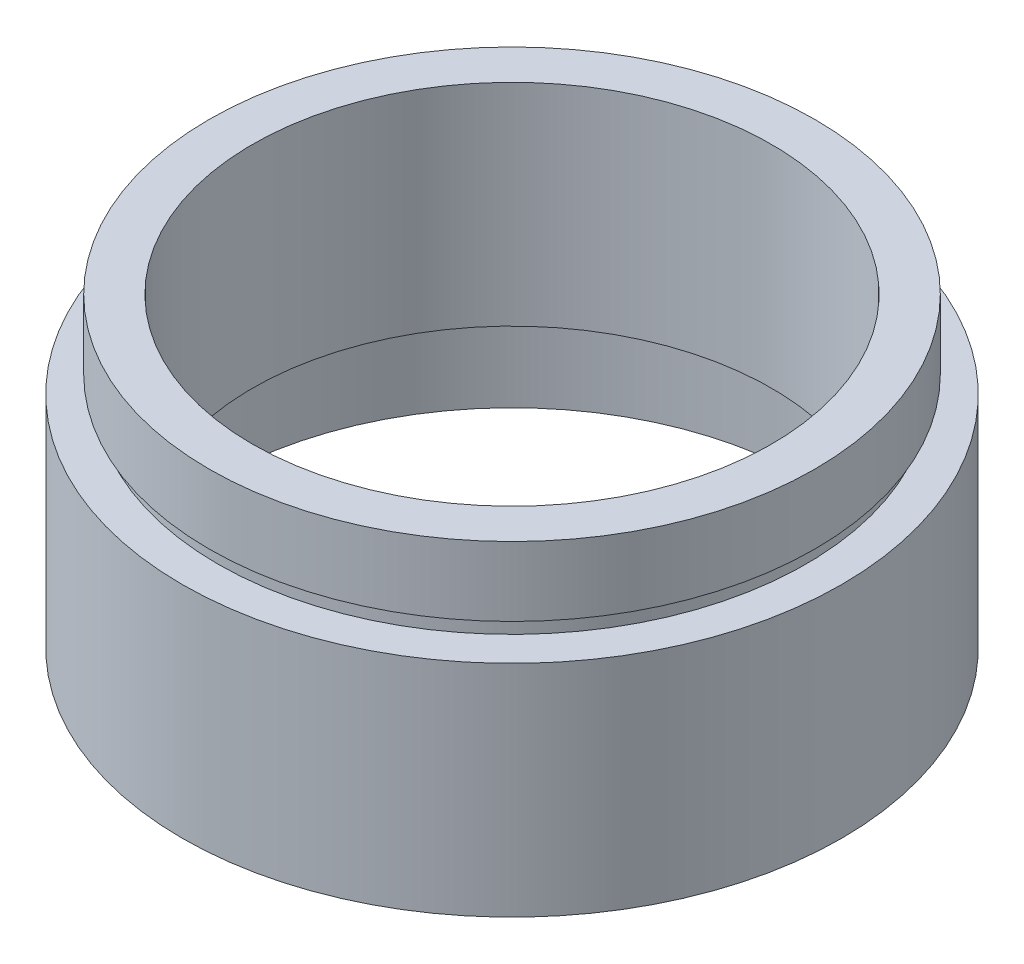
ISO-10303-21;
HEADER;
FILE_DESCRIPTION(('STEP AP214'),'2;1');
FILE_NAME('part.step','',(''),(''),'','','');
FILE_SCHEMA(('AUTOMOTIVE_DESIGN { 1 0 10303 214 1 1 1 1 }'));
ENDSEC;
DATA;
#1=APPLICATION_CONTEXT('core data for automotive mechanical design processes');
#2=APPLICATION_PROTOCOL_DEFINITION('international standard','automotive_design',2000,#1);
#3=PRODUCT_CONTEXT('',#1,'mechanical');
#4=PRODUCT('Part','Part','',(#3));
#5=PRODUCT_RELATED_PRODUCT_CATEGORY('part','',(#4));
#6=PRODUCT_DEFINITION_FORMATION('','',#4);
#7=PRODUCT_DEFINITION_CONTEXT('part definition',#1,'design');
#8=PRODUCT_DEFINITION('design','',#6,#7);
#9=PRODUCT_DEFINITION_SHAPE('','',#8);
#10=(LENGTH_UNIT() NAMED_UNIT(*) SI_UNIT(.MILLI.,.METRE.));
#11=(NAMED_UNIT(*) PLANE_ANGLE_UNIT() SI_UNIT($,.RADIAN.));
#12=(NAMED_UNIT(*) SI_UNIT($,.STERADIAN.) SOLID_ANGLE_UNIT());
#13=UNCERTAINTY_MEASURE_WITH_UNIT(LENGTH_MEASURE(1.E-05),#10,'distance_accuracy_value','');
#14=(GEOMETRIC_REPRESENTATION_CONTEXT(3) GLOBAL_UNCERTAINTY_ASSIGNED_CONTEXT((#13)) GLOBAL_UNIT_ASSIGNED_CONTEXT((#10,
#11,#12)) REPRESENTATION_CONTEXT('',''));
#15=CARTESIAN_POINT('',(0.,0.,0.));
#16=DIRECTION('',(0.,0.,1.));
#17=DIRECTION('',(1.,0.,0.));
#18=AXIS2_PLACEMENT_3D('',#15,#16,#17);
#19=CARTESIAN_POINT('',(17.,0.,0.));
#20=DIRECTION('',(0.,1.,0.));
#21=DIRECTION('',(0.,0.,1.));
#22=AXIS2_PLACEMENT_3D('',#19,#20,#21);
#23=PLANE('',#22);
#24=CARTESIAN_POINT('',(0.,0.,0.));
#25=DIRECTION('',(0.,1.,0.));
#26=DIRECTION('',(0.,0.,1.));
#27=AXIS2_PLACEMENT_3D('',#24,#25,#26);
#28=CIRCLE('',#27,19.05);
#29=CARTESIAN_POINT('',(0.,0.,19.05));
#30=VERTEX_POINT('',#29);
#31=EDGE_CURVE('E10',#30,#30,#28,.T.);
#32=ORIENTED_EDGE('',*,*,#31,.F.);
#33=EDGE_LOOP('',(#32));
#34=FACE_BOUND('',#33,.T.);
#35=CARTESIAN_POINT('',(0.,0.,0.));
#36=DIRECTION('',(0.,1.,0.));
#37=DIRECTION('',(0.,0.,1.));
#38=AXIS2_PLACEMENT_3D('',#35,#36,#37);
#39=CIRCLE('',#38,17.);
#40=CARTESIAN_POINT('',(0.,0.,17.));
#41=VERTEX_POINT('',#40);
#42=EDGE_CURVE('E77',#41,#41,#39,.T.);
#43=ORIENTED_EDGE('',*,*,#42,.T.);
#44=EDGE_LOOP('',(#43));
#45=FACE_BOUND('',#44,.T.);
#46=ADVANCED_FACE('F37',(#34,#45),#23,.F.);
#47=CARTESIAN_POINT('',(0.,161.376166943427,0.));
#48=DIRECTION('',(0.,1.,0.));
#49=DIRECTION('',(0.,0.,1.));
#50=AXIS2_PLACEMENT_3D('',#47,#48,#49);
#51=CYLINDRICAL_SURFACE('',#50,19.05);
#52=CARTESIAN_POINT('',(0.,12.7,0.));
#53=DIRECTION('',(0.,1.,0.));
#54=DIRECTION('',(0.,0.,1.));
#55=AXIS2_PLACEMENT_3D('',#52,#53,#54);
#56=CIRCLE('',#55,19.05);
#57=CARTESIAN_POINT('',(0.,12.7,19.05));
#58=VERTEX_POINT('',#57);
#59=EDGE_CURVE('E43',#58,#58,#56,.T.);
#60=ORIENTED_EDGE('',*,*,#59,.F.);
#61=EDGE_LOOP('',(#60));
#62=FACE_BOUND('',#61,.T.);
#63=ORIENTED_EDGE('',*,*,#31,.T.);
#64=EDGE_LOOP('',(#63));
#65=FACE_BOUND('',#64,.T.);
#66=ADVANCED_FACE('F138',(#62,#65),#51,.T.);
#67=CARTESIAN_POINT('',(19.05,12.7,0.));
#68=DIRECTION('',(0.,-1.,0.));
#69=DIRECTION('',(0.,0.,-1.));
#70=AXIS2_PLACEMENT_3D('',#67,#68,#69);
#71=PLANE('',#70);
#72=CARTESIAN_POINT('',(0.,12.7,0.));
#73=DIRECTION('',(0.,1.,0.));
#74=DIRECTION('',(0.,0.,1.));
#75=AXIS2_PLACEMENT_3D('',#72,#73,#74);
#76=CIRCLE('',#75,17.);
#77=CARTESIAN_POINT('',(0.,12.7,17.));
#78=VERTEX_POINT('',#77);
#79=EDGE_CURVE('E47',#78,#78,#76,.T.);
#80=ORIENTED_EDGE('',*,*,#79,.F.);
#81=EDGE_LOOP('',(#80));
#82=FACE_BOUND('',#81,.T.);
#83=ORIENTED_EDGE('',*,*,#59,.T.);
#84=EDGE_LOOP('',(#83));
#85=FACE_BOUND('',#84,.T.);
#86=ADVANCED_FACE('F133',(#82,#85),#71,.F.);
#87=CARTESIAN_POINT('',(0.,161.376166943427,0.));
#88=DIRECTION('',(0.,1.,0.));
#89=DIRECTION('',(0.,0.,1.));
#90=AXIS2_PLACEMENT_3D('',#87,#88,#89);
#91=CYLINDRICAL_SURFACE('',#90,17.);
#92=CARTESIAN_POINT('',(0.,13.7,0.));
#93=DIRECTION('',(0.,1.,0.));
#94=DIRECTION('',(0.,0.,1.));
#95=AXIS2_PLACEMENT_3D('',#92,#93,#94);
#96=CIRCLE('',#95,17.);
#97=CARTESIAN_POINT('',(0.,13.7,17.));
#98=VERTEX_POINT('',#97);
#99=EDGE_CURVE('E51',#98,#98,#96,.T.);
#100=ORIENTED_EDGE('',*,*,#99,.F.);
#101=EDGE_LOOP('',(#100));
#102=FACE_BOUND('',#101,.T.);
#103=ORIENTED_EDGE('',*,*,#79,.T.);
#104=EDGE_LOOP('',(#103));
#105=FACE_BOUND('',#104,.T.);
#106=ADVANCED_FACE('F127',(#102,#105),#91,.T.);
#107=CARTESIAN_POINT('',(17.,13.7,0.));
#108=DIRECTION('',(0.,1.,0.));
#109=DIRECTION('',(0.,0.,1.));
#110=AXIS2_PLACEMENT_3D('',#107,#108,#109);
#111=PLANE('',#110);
#112=CARTESIAN_POINT('',(0.,13.7,0.));
#113=DIRECTION('',(0.,1.,0.));
#114=DIRECTION('',(0.,0.,1.));
#115=AXIS2_PLACEMENT_3D('',#112,#113,#114);
#116=CIRCLE('',#115,17.5);
#117=CARTESIAN_POINT('',(0.,13.7,17.5));
#118=VERTEX_POINT('',#117);
#119=EDGE_CURVE('E56',#118,#118,#116,.T.);
#120=ORIENTED_EDGE('',*,*,#119,.F.);
#121=EDGE_LOOP('',(#120));
#122=FACE_BOUND('',#121,.T.);
#123=ORIENTED_EDGE('',*,*,#99,.T.);
#124=EDGE_LOOP('',(#123));
#125=FACE_BOUND('',#124,.T.);
#126=ADVANCED_FACE('F121',(#122,#125),#111,.F.);
#127=CARTESIAN_POINT('',(0.,161.376166943427,0.));
#128=DIRECTION('',(0.,1.,0.));
#129=DIRECTION('',(0.,0.,1.));
#130=AXIS2_PLACEMENT_3D('',#127,#128,#129);
#131=CYLINDRICAL_SURFACE('',#130,17.5);
#132=CARTESIAN_POINT('',(0.,17.7,0.));
#133=DIRECTION('',(0.,1.,0.));
#134=DIRECTION('',(0.,0.,1.));
#135=AXIS2_PLACEMENT_3D('',#132,#133,#134);
#136=CIRCLE('',#135,17.5);
#137=CARTESIAN_POINT('',(0.,17.7,17.5));
#138=VERTEX_POINT('',#137);
#139=EDGE_CURVE('E59',#138,#138,#136,.T.);
#140=ORIENTED_EDGE('',*,*,#139,.F.);
#141=EDGE_LOOP('',(#140));
#142=FACE_BOUND('',#141,.T.);
#143=ORIENTED_EDGE('',*,*,#119,.T.);
#144=EDGE_LOOP('',(#143));
#145=FACE_BOUND('',#144,.T.);
#146=ADVANCED_FACE('F115',(#142,#145),#131,.T.);
#147=CARTESIAN_POINT('',(17.5,17.7,0.));
#148=DIRECTION('',(0.,-1.,0.));
#149=DIRECTION('',(0.,0.,-1.));
#150=AXIS2_PLACEMENT_3D('',#147,#148,#149);
#151=PLANE('',#150);
#152=CARTESIAN_POINT('',(0.,17.7,0.));
#153=DIRECTION('',(0.,1.,0.));
#154=DIRECTION('',(0.,0.,1.));
#155=AXIS2_PLACEMENT_3D('',#152,#153,#154);
#156=CIRCLE('',#155,15.);
#157=CARTESIAN_POINT('',(0.,17.7,15.));
#158=VERTEX_POINT('',#157);
#159=EDGE_CURVE('E62',#158,#158,#156,.T.);
#160=ORIENTED_EDGE('',*,*,#159,.F.);
#161=EDGE_LOOP('',(#160));
#162=FACE_BOUND('',#161,.T.);
#163=ORIENTED_EDGE('',*,*,#139,.T.);
#164=EDGE_LOOP('',(#163));
#165=FACE_BOUND('',#164,.T.);
#166=ADVANCED_FACE('F109',(#162,#165),#151,.F.);
#167=CARTESIAN_POINT('',(0.,161.376166943427,0.));
#168=DIRECTION('',(0.,1.,0.));
#169=DIRECTION('',(0.,0.,1.));
#170=AXIS2_PLACEMENT_3D('',#167,#168,#169);
#171=CYLINDRICAL_SURFACE('',#170,15.);
#172=CARTESIAN_POINT('',(0.,5.49999999999998,0.));
#173=DIRECTION('',(0.,1.,0.));
#174=DIRECTION('',(0.,0.,1.));
#175=AXIS2_PLACEMENT_3D('',#172,#173,#174);
#176=CIRCLE('',#175,15.);
#177=CARTESIAN_POINT('',(0.,5.49999999999998,15.));
#178=VERTEX_POINT('',#177);
#179=EDGE_CURVE('E65',#178,#178,#176,.T.);
#180=ORIENTED_EDGE('',*,*,#179,.F.);
#181=EDGE_LOOP('',(#180));
#182=FACE_BOUND('',#181,.T.);
#183=ORIENTED_EDGE('',*,*,#159,.T.);
#184=EDGE_LOOP('',(#183));
#185=FACE_BOUND('',#184,.T.);
#186=ADVANCED_FACE('F103',(#182,#185),#171,.F.);
#187=CARTESIAN_POINT('',(17.6,5.49999999999998,0.));
#188=DIRECTION('',(0.,1.,0.));
#189=DIRECTION('',(0.,0.,1.));
#190=AXIS2_PLACEMENT_3D('',#187,#188,#189);
#191=PLANE('',#190);
#192=CARTESIAN_POINT('',(0.,5.49999999999998,0.));
#193=DIRECTION('',(0.,1.,0.));
#194=DIRECTION('',(0.,0.,1.));
#195=AXIS2_PLACEMENT_3D('',#192,#193,#194);
#196=CIRCLE('',#195,17.6);
#197=CARTESIAN_POINT('',(0.,5.49999999999998,17.6));
#198=VERTEX_POINT('',#197);
#199=EDGE_CURVE('E68',#198,#198,#196,.T.);
#200=ORIENTED_EDGE('',*,*,#199,.F.);
#201=EDGE_LOOP('',(#200));
#202=FACE_BOUND('',#201,.T.);
#203=ORIENTED_EDGE('',*,*,#179,.T.);
#204=EDGE_LOOP('',(#203));
#205=FACE_BOUND('',#204,.T.);
#206=ADVANCED_FACE('F97',(#202,#205),#191,.F.);
#207=CARTESIAN_POINT('',(0.,161.376166943427,0.));
#208=DIRECTION('',(0.,1.,0.));
#209=DIRECTION('',(0.,0.,1.));
#210=AXIS2_PLACEMENT_3D('',#207,#208,#209);
#211=CYLINDRICAL_SURFACE('',#210,17.6);
#212=CARTESIAN_POINT('',(0.,4.49999999999998,0.));
#213=DIRECTION('',(0.,1.,0.));
#214=DIRECTION('',(0.,0.,1.));
#215=AXIS2_PLACEMENT_3D('',#212,#213,#214);
#216=CIRCLE('',#215,17.6);
#217=CARTESIAN_POINT('',(0.,4.49999999999998,17.6));
#218=VERTEX_POINT('',#217);
#219=EDGE_CURVE('E71',#218,#218,#216,.T.);
#220=ORIENTED_EDGE('',*,*,#219,.F.);
#221=EDGE_LOOP('',(#220));
#222=FACE_BOUND('',#221,.T.);
#223=ORIENTED_EDGE('',*,*,#199,.T.);
#224=EDGE_LOOP('',(#223));
#225=FACE_BOUND('',#224,.T.);
#226=ADVANCED_FACE('F91',(#222,#225),#211,.F.);
#227=CARTESIAN_POINT('',(17.,4.49999999999998,0.));
#228=DIRECTION('',(0.,-1.,0.));
#229=DIRECTION('',(0.,0.,-1.));
#230=AXIS2_PLACEMENT_3D('',#227,#228,#229);
#231=PLANE('',#230);
#232=CARTESIAN_POINT('',(0.,4.49999999999998,0.));
#233=DIRECTION('',(0.,1.,0.));
#234=DIRECTION('',(0.,0.,1.));
#235=AXIS2_PLACEMENT_3D('',#232,#233,#234);
#236=CIRCLE('',#235,17.);
#237=CARTESIAN_POINT('',(0.,4.49999999999998,17.));
#238=VERTEX_POINT('',#237);
#239=EDGE_CURVE('E74',#238,#238,#236,.T.);
#240=ORIENTED_EDGE('',*,*,#239,.F.);
#241=EDGE_LOOP('',(#240));
#242=FACE_BOUND('',#241,.T.);
#243=ORIENTED_EDGE('',*,*,#219,.T.);
#244=EDGE_LOOP('',(#243));
#245=FACE_BOUND('',#244,.T.);
#246=ADVANCED_FACE('F85',(#242,#245),#231,.F.);
#247=CARTESIAN_POINT('',(0.,161.376166943427,0.));
#248=DIRECTION('',(0.,1.,0.));
#249=DIRECTION('',(0.,0.,1.));
#250=AXIS2_PLACEMENT_3D('',#247,#248,#249);
#251=CYLINDRICAL_SURFACE('',#250,17.);
#252=ORIENTED_EDGE('',*,*,#42,.F.);
#253=EDGE_LOOP('',(#252));
#254=FACE_BOUND('',#253,.T.);
#255=ORIENTED_EDGE('',*,*,#239,.T.);
#256=EDGE_LOOP('',(#255));
#257=FACE_BOUND('',#256,.T.);
#258=ADVANCED_FACE('F82',(#254,#257),#251,.F.);
#259=CLOSED_SHELL('',(#46,#66,#86,#106,#126,#146,#166,#186,#206,#226,#246,#258));
#260=MANIFOLD_SOLID_BREP('B2',#259);
#261=ADVANCED_BREP_SHAPE_REPRESENTATION('',(#18,#260),#14);
#262=SHAPE_DEFINITION_REPRESENTATION(#9,#261);
ENDSEC;
END-ISO-10303-21;
